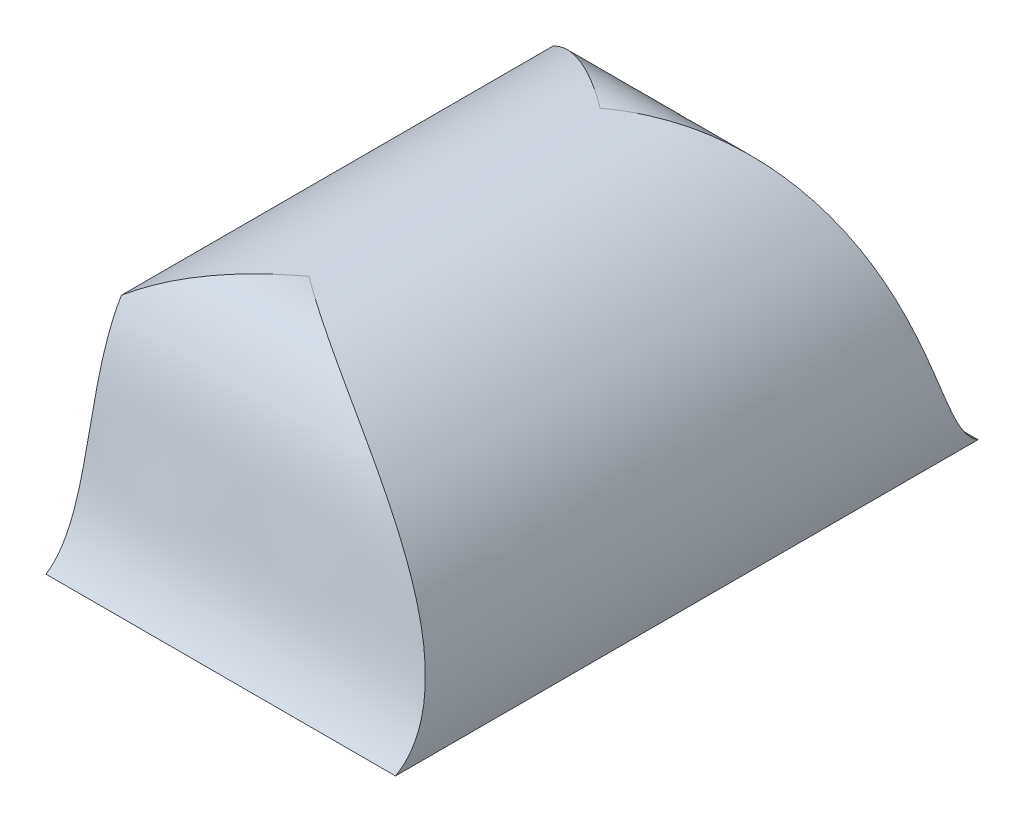
ISO-10303-21;
HEADER;
FILE_DESCRIPTION(('STEP AP214'),'2;1');
FILE_NAME('part.step','',(''),(''),'','','');
FILE_SCHEMA(('AUTOMOTIVE_DESIGN { 1 0 10303 214 1 1 1 1 }'));
ENDSEC;
DATA;
#1=APPLICATION_CONTEXT('core data for automotive mechanical design processes');
#2=APPLICATION_PROTOCOL_DEFINITION('international standard','automotive_design',2000,#1);
#3=PRODUCT_CONTEXT('',#1,'mechanical');
#4=PRODUCT('Part','Part','',(#3));
#5=PRODUCT_RELATED_PRODUCT_CATEGORY('part','',(#4));
#6=PRODUCT_DEFINITION_FORMATION('','',#4);
#7=PRODUCT_DEFINITION_CONTEXT('part definition',#1,'design');
#8=PRODUCT_DEFINITION('design','',#6,#7);
#9=PRODUCT_DEFINITION_SHAPE('','',#8);
#10=(LENGTH_UNIT() NAMED_UNIT(*) SI_UNIT(.MILLI.,.METRE.));
#11=(NAMED_UNIT(*) PLANE_ANGLE_UNIT() SI_UNIT($,.RADIAN.));
#12=(NAMED_UNIT(*) SI_UNIT($,.STERADIAN.) SOLID_ANGLE_UNIT());
#13=UNCERTAINTY_MEASURE_WITH_UNIT(LENGTH_MEASURE(1.E-05),#10,'distance_accuracy_value','');
#14=(GEOMETRIC_REPRESENTATION_CONTEXT(3) GLOBAL_UNCERTAINTY_ASSIGNED_CONTEXT((#13)) GLOBAL_UNIT_ASSIGNED_CONTEXT((#10,
#11,#12)) REPRESENTATION_CONTEXT('',''));
#15=CARTESIAN_POINT('',(0.,0.,0.));
#16=DIRECTION('',(0.,0.,1.));
#17=DIRECTION('',(1.,0.,0.));
#18=AXIS2_PLACEMENT_3D('',#15,#16,#17);
#19=CARTESIAN_POINT('',(0.6,0.,0.25));
#20=CARTESIAN_POINT('',(0.626819788030723,0.289928397578695,0.25));
#21=CARTESIAN_POINT('',(0.257985515738042,0.545390799762338,0.25));
#22=CARTESIAN_POINT('',(0.,0.35,0.25));
#23=B_SPLINE_CURVE_WITH_KNOTS('',3,(#19,#20,#21,#22),.UNSPECIFIED.,.F.,.F.,(4,4),(0.,1.),.UNSPECIFIED.);
#24=DIRECTION('',(0.,0.,-1.));
#25=VECTOR('',#24,1.);
#26=SURFACE_OF_LINEAR_EXTRUSION('',#23,#25);
#27=DIRECTION('',(0.,0.,-1.));
#28=VECTOR('',#27,1.);
#29=CARTESIAN_POINT('',(0.,0.35,0.25));
#30=LINE('',#29,#28);
#31=CARTESIAN_POINT('',(0.,0.349999999403882,0.370521911412625));
#32=VERTEX_POINT('',#31);
#33=CARTESIAN_POINT('',(0.,0.35,-0.370521911412625));
#34=VERTEX_POINT('',#33);
#35=EDGE_CURVE('E53',#32,#34,#30,.T.);
#36=ORIENTED_EDGE('',*,*,#35,.F.);
#37=CARTESIAN_POINT('',(0.,0.349999999999997,0.370521911049339));
#38=CARTESIAN_POINT('',(0.00825527885618861,0.356255849450693,0.366712872777325));
#39=CARTESIAN_POINT('',(0.01670774569311,0.362105432406488,0.362678678142125));
#40=CARTESIAN_POINT('',(0.0339234244274184,0.372950656876308,0.354163679151032));
#41=CARTESIAN_POINT('',(0.0426864991470208,0.377946669826716,0.349683070405773));
#42=CARTESIAN_POINT('',(0.0692006872566339,0.391535029749839,0.335639015499935));
#43=CARTESIAN_POINT('',(0.0872968181289452,0.398817946316962,0.325418908973627));
#44=CARTESIAN_POINT('',(0.121098640930965,0.409136187235741,0.305036802703458));
#45=CARTESIAN_POINT('',(0.136788344406358,0.412620049119834,0.29506273608286));
#46=CARTESIAN_POINT('',(0.167911899364637,0.417252919245855,0.274235900732327));
#47=CARTESIAN_POINT('',(0.183345927724373,0.418403614738341,0.263383772890552));
#48=CARTESIAN_POINT('',(0.199505616780379,0.418544612505018,0.251466641467701));
#49=CARTESIAN_POINT('',(0.2004959868034,0.418548912358348,0.250734018721069));
#50=CARTESIAN_POINT('',(0.20148518074984,0.418548901834156,0.25));
#51=B_SPLINE_CURVE_WITH_KNOTS('',3,(#37,#38,#39,#40,#41,#42,#43,#44,#45,#46,#47,#48,#49,#50),
.UNSPECIFIED.,.F.,.F.,(4,2,2,2,2,2,4),(0.,0.0330862202839932,0.0661580060149827,
0.131829646521694,0.188407274208213,0.244943972653786,0.248639634344501),.UNSPECIFIED.);
#52=CARTESIAN_POINT('',(0.201485180749996,0.418548901834156,0.25));
#53=VERTEX_POINT('',#52);
#54=EDGE_CURVE('E88',#32,#53,#51,.T.);
#55=ORIENTED_EDGE('',*,*,#54,.T.);
#56=CARTESIAN_POINT('',(0.6,0.,0.5));
#57=CARTESIAN_POINT('',(0.600309456843271,0.00328595093172608,0.494965112052997));
#58=CARTESIAN_POINT('',(0.600610500159222,0.00713623887497123,0.490374210968532));
#59=CARTESIAN_POINT('',(0.601089507162062,0.0155632954519763,0.482064447642185));
#60=CARTESIAN_POINT('',(0.601269609789353,0.0201255775204056,0.47833124373096));
#61=CARTESIAN_POINT('',(0.601454954538251,0.0320253042292035,0.469911865294647));
#62=CARTESIAN_POINT('',(0.601334354444628,0.0396417637507074,0.465631526865669));
#63=CARTESIAN_POINT('',(0.600497506607325,0.0553849172072791,0.458063979399536));
#64=CARTESIAN_POINT('',(0.599775335927399,0.0635159388713859,0.454787090636494));
#65=CARTESIAN_POINT('',(0.596748385181316,0.0872787410461483,0.446276502410716));
#66=CARTESIAN_POINT('',(0.593605748882381,0.103113037235993,0.441914948246667));
#67=CARTESIAN_POINT('',(0.5850967919933,0.134370708740922,0.43422445179017));
#68=CARTESIAN_POINT('',(0.579731364935154,0.149794246526878,0.430895095507223));
#69=CARTESIAN_POINT('',(0.564450389619757,0.185923664821895,0.423273653674747));
#70=CARTESIAN_POINT('',(0.553572727417092,0.206259340928663,0.419132877391412));
#71=CARTESIAN_POINT('',(0.528627154892707,0.244755632950418,0.410362891631758));
#72=CARTESIAN_POINT('',(0.514555513806971,0.262913667032004,0.405733114380721));
#73=CARTESIAN_POINT('',(0.483760308356701,0.296816735105153,0.395298023187908));
#74=CARTESIAN_POINT('',(0.467009350638104,0.312533119150924,0.389480372983261));
#75=CARTESIAN_POINT('',(0.431674713054268,0.34095582958504,0.376272103483193));
#76=CARTESIAN_POINT('',(0.413091112238233,0.353662285723215,0.368881552017362));
#77=CARTESIAN_POINT('',(0.37410456686757,0.37618621593128,0.351965538274795));
#78=CARTESIAN_POINT('',(0.353659961186571,0.385881205949137,0.342371952666841));
#79=CARTESIAN_POINT('',(0.312432573313025,0.401528263512743,0.321154569651431));
#80=CARTESIAN_POINT('',(0.291650113315865,0.407483704514568,0.309532614173704));
#81=CARTESIAN_POINT('',(0.248455423708947,0.416086356109303,0.283111456839611));
#82=CARTESIAN_POINT('',(0.226085830064731,0.418347151703636,0.268111510903899));
#83=CARTESIAN_POINT('',(0.203465071608549,0.418544642715857,0.251466128242887));
#84=CARTESIAN_POINT('',(0.202474322305935,0.418548944688426,0.250734015315585));
#85=CARTESIAN_POINT('',(0.20148518074984,0.418548901834156,0.25));
#86=B_SPLINE_CURVE_WITH_KNOTS('',3,(#56,#57,#58,#59,#60,#61,#62,#63,#64,#65,#66,#67,#68,#69,#70,
#71,#72,#73,#74,#75,#76,#77,#78,#79,#80,#81,#82,#83,#84,#85),.UNSPECIFIED.,.F.,.F.,(4,2,2,2,2,2,
2,2,2,2,2,2,2,2,4),(0.,0.0179271297373814,0.0355282081543646,0.0615987211301575,
0.0879289952653558,0.137815573256445,0.187682116942603,0.257603420179295,0.327606819977274,
0.398378012167399,0.469146153047947,0.542499334026183,0.615786247498508,0.696337234710239,
0.700032899617386),.UNSPECIFIED.);
#87=CARTESIAN_POINT('',(0.6,0.,0.5));
#88=VERTEX_POINT('',#87);
#89=EDGE_CURVE('E90',#53,#88,#86,.F.);
#90=ORIENTED_EDGE('',*,*,#89,.T.);
#91=DIRECTION('',(0.,0.,-1.));
#92=VECTOR('',#91,1.);
#93=CARTESIAN_POINT('',(0.6,0.,0.25));
#94=LINE('',#93,#92);
#95=CARTESIAN_POINT('',(0.6,0.,-0.5));
#96=VERTEX_POINT('',#95);
#97=EDGE_CURVE('E102',#88,#96,#94,.T.);
#98=ORIENTED_EDGE('',*,*,#97,.T.);
#99=CARTESIAN_POINT('',(0.6,0.,-0.5));
#100=CARTESIAN_POINT('',(0.600309456843271,0.00328595093172607,-0.494965112052997));
#101=CARTESIAN_POINT('',(0.600610500159222,0.00713623887497124,-0.490374210968532));
#102=CARTESIAN_POINT('',(0.601089507162062,0.0155632954519763,-0.482064447642185));
#103=CARTESIAN_POINT('',(0.601269609789353,0.0201255775204056,-0.47833124373096));
#104=CARTESIAN_POINT('',(0.601454954538251,0.0320253042292035,-0.469911865294647));
#105=CARTESIAN_POINT('',(0.601334354444628,0.0396417637507074,-0.465631526865669));
#106=CARTESIAN_POINT('',(0.600497506607325,0.0553849172072791,-0.458063979399536));
#107=CARTESIAN_POINT('',(0.5997753359274,0.0635159388713859,-0.454787090636494));
#108=CARTESIAN_POINT('',(0.596748385181316,0.0872787410461483,-0.446276502410716));
#109=CARTESIAN_POINT('',(0.593605748882381,0.103113037235993,-0.441914948246667));
#110=CARTESIAN_POINT('',(0.585096791993299,0.134370708740922,-0.43422445179017));
#111=CARTESIAN_POINT('',(0.579731364935154,0.149794246526878,-0.430895095507223));
#112=CARTESIAN_POINT('',(0.564450389619757,0.185923664821896,-0.423273653674747));
#113=CARTESIAN_POINT('',(0.553572727417092,0.206259340928664,-0.419132877391411));
#114=CARTESIAN_POINT('',(0.528627154892706,0.244755632950419,-0.410362891631758));
#115=CARTESIAN_POINT('',(0.51455551380697,0.262913667032004,-0.40573311438072));
#116=CARTESIAN_POINT('',(0.4837603083567,0.296816735105154,-0.395298023187908));
#117=CARTESIAN_POINT('',(0.467009350638103,0.312533119150925,-0.389480372983261));
#118=CARTESIAN_POINT('',(0.431674713054267,0.340955829585041,-0.376272103483192));
#119=CARTESIAN_POINT('',(0.413091112238231,0.353662285723216,-0.368881552017362));
#120=CARTESIAN_POINT('',(0.374104566867568,0.376186215931281,-0.351965538274795));
#121=CARTESIAN_POINT('',(0.353659961186569,0.385881205949137,-0.342371952666839));
#122=CARTESIAN_POINT('',(0.312432573313022,0.401528263512743,-0.321154569651431));
#123=CARTESIAN_POINT('',(0.291650113315862,0.407483704514568,-0.309532614173706));
#124=CARTESIAN_POINT('',(0.248455423708948,0.416086356109303,-0.283111456839608));
#125=CARTESIAN_POINT('',(0.226085830064738,0.418347151703636,-0.268111510903888));
#126=CARTESIAN_POINT('',(0.203465071608549,0.418544642715857,-0.251466128242886));
#127=CARTESIAN_POINT('',(0.202474322305935,0.418548944688426,-0.250734015315584));
#128=CARTESIAN_POINT('',(0.20148518074984,0.418548901834156,-0.25));
#129=B_SPLINE_CURVE_WITH_KNOTS('',3,(#99,#100,#101,#102,#103,#104,#105,#106,#107,#108,#109,#110,
#111,#112,#113,#114,#115,#116,#117,#118,#119,#120,#121,#122,#123,#124,#125,#126,#127,#128),
.UNSPECIFIED.,.F.,.F.,(4,2,2,2,2,2,2,2,2,2,2,2,2,2,4),(0.,0.0179271297373815,0.0355282081543646,
0.0615987211301575,0.0879289952653557,0.137815573256446,0.187682116942604,0.257603420179296,
0.327606819977276,0.3983780121674,0.469146153047948,0.542499334026186,0.615786247498509,
0.696337234710239,0.700032899617385),.UNSPECIFIED.);
#130=CARTESIAN_POINT('',(0.201486085555685,0.418548901832957,-0.25));
#131=VERTEX_POINT('',#130);
#132=EDGE_CURVE('E133',#131,#96,#129,.F.);
#133=ORIENTED_EDGE('',*,*,#132,.F.);
#134=CARTESIAN_POINT('',(0.,0.349999999999997,-0.370521911049339));
#135=CARTESIAN_POINT('',(0.00825527885619393,0.356255849450697,-0.366712872777322));
#136=CARTESIAN_POINT('',(0.0167077456931216,0.362105432406496,-0.362678678142119));
#137=CARTESIAN_POINT('',(0.0339234244274423,0.372950656876322,-0.354163679151021));
#138=CARTESIAN_POINT('',(0.0426864991470509,0.377946669826733,-0.349683070405758));
#139=CARTESIAN_POINT('',(0.0692006872566738,0.391535029749857,-0.335639015499912));
#140=CARTESIAN_POINT('',(0.087296818128987,0.398817946316979,-0.325418908973595));
#141=CARTESIAN_POINT('',(0.121098640931009,0.409136187235751,-0.305036802703437));
#142=CARTESIAN_POINT('',(0.136788344406402,0.412620049119839,-0.295062736082856));
#143=CARTESIAN_POINT('',(0.16791189936464,0.417252919245856,-0.2742359007323));
#144=CARTESIAN_POINT('',(0.183345927724335,0.418403614738342,-0.263383772890485));
#145=CARTESIAN_POINT('',(0.199505616780374,0.418544612505018,-0.251466641467692));
#146=CARTESIAN_POINT('',(0.200495986803397,0.418548912358348,-0.250734018721065));
#147=CARTESIAN_POINT('',(0.20148518074984,0.418548901834156,-0.25));
#148=B_SPLINE_CURVE_WITH_KNOTS('',3,(#134,#135,#136,#137,#138,#139,#140,#141,#142,#143,#144,
#145,#146,#147),.UNSPECIFIED.,.F.,.F.,(4,2,2,2,2,2,4),(0.,0.0330862202840161,0.0661580060150272,
0.131829646521755,0.18840727420824,0.244943972653787,0.2486396343445),.UNSPECIFIED.);
#149=EDGE_CURVE('E11',#34,#131,#148,.T.);
#150=ORIENTED_EDGE('',*,*,#149,.F.);
#151=EDGE_LOOP('',(#36,#55,#90,#98,#133,#150));
#152=FACE_BOUND('',#151,.T.);
#153=ADVANCED_FACE('F39',(#152),#26,.F.);
#154=CARTESIAN_POINT('',(0.,0.35,0.25));
#155=DIRECTION('',(1.,0.,0.));
#156=DIRECTION('',(0.,1.,0.));
#157=AXIS2_PLACEMENT_3D('',#154,#155,#156);
#158=PLANE('',#157);
#159=CARTESIAN_POINT('',(0.,0.,0.5));
#160=CARTESIAN_POINT('',(0.,0.0714905444473845,0.390864989579389));
#161=CARTESIAN_POINT('',(0.,0.418548901834156,0.458561006871926));
#162=CARTESIAN_POINT('',(0.,0.418548901834156,0.25));
#163=B_SPLINE_CURVE_WITH_KNOTS('',3,(#159,#160,#161,#162),.UNSPECIFIED.,.F.,.F.,(4,4),(0.,1.),.UNSPECIFIED.);
#164=CARTESIAN_POINT('',(0.,0.,0.5));
#165=VERTEX_POINT('',#164);
#166=EDGE_CURVE('E107',#165,#32,#163,.T.);
#167=ORIENTED_EDGE('',*,*,#166,.T.);
#168=ORIENTED_EDGE('',*,*,#35,.T.);
#169=CARTESIAN_POINT('',(0.,0.,-0.5));
#170=CARTESIAN_POINT('',(0.,0.0714905444473845,-0.390864989579389));
#171=CARTESIAN_POINT('',(0.,0.418548901834156,-0.458561006871926));
#172=CARTESIAN_POINT('',(0.,0.418548901834156,-0.25));
#173=B_SPLINE_CURVE_WITH_KNOTS('',3,(#169,#170,#171,#172),.UNSPECIFIED.,.F.,.F.,(4,4),(0.,1.),.UNSPECIFIED.);
#174=CARTESIAN_POINT('',(0.,0.,-0.5));
#175=VERTEX_POINT('',#174);
#176=EDGE_CURVE('E96',#175,#34,#173,.T.);
#177=ORIENTED_EDGE('',*,*,#176,.F.);
#178=DIRECTION('',(0.,0.,-1.));
#179=VECTOR('',#178,1.);
#180=CARTESIAN_POINT('',(0.,0.,0.25));
#181=LINE('',#180,#179);
#182=EDGE_CURVE('E105',#165,#175,#181,.T.);
#183=ORIENTED_EDGE('',*,*,#182,.F.);
#184=EDGE_LOOP('',(#167,#168,#177,#183));
#185=FACE_BOUND('',#184,.T.);
#186=ADVANCED_FACE('F158',(#185),#158,.F.);
#187=CARTESIAN_POINT('',(0.,0.,0.25));
#188=DIRECTION('',(0.,1.,0.));
#189=DIRECTION('',(0.,0.,1.));
#190=AXIS2_PLACEMENT_3D('',#187,#188,#189);
#191=PLANE('',#190);
#192=ORIENTED_EDGE('',*,*,#182,.T.);
#193=DIRECTION('',(-1.,0.,0.));
#194=VECTOR('',#193,1.);
#195=CARTESIAN_POINT('',(0.627446635869675,0.,-0.5));
#196=LINE('',#195,#194);
#197=EDGE_CURVE('E115',#96,#175,#196,.T.);
#198=ORIENTED_EDGE('',*,*,#197,.F.);
#199=ORIENTED_EDGE('',*,*,#97,.F.);
#200=DIRECTION('',(-1.,0.,0.));
#201=VECTOR('',#200,1.);
#202=CARTESIAN_POINT('',(0.614409894015362,0.,0.5));
#203=LINE('',#202,#201);
#204=EDGE_CURVE('E100',#88,#165,#203,.T.);
#205=ORIENTED_EDGE('',*,*,#204,.T.);
#206=EDGE_LOOP('',(#192,#198,#199,#205));
#207=FACE_BOUND('',#206,.T.);
#208=ADVANCED_FACE('F125',(#207),#191,.F.);
#209=CARTESIAN_POINT('',(0.614409894015362,0.,0.5));
#210=CARTESIAN_POINT('',(0.614409894015362,0.0714905444473845,0.390864989579389));
#211=CARTESIAN_POINT('',(0.614409894015362,0.418548901834156,0.458561006871926));
#212=CARTESIAN_POINT('',(0.614409894015362,0.418548901834156,0.25));
#213=B_SPLINE_CURVE_WITH_KNOTS('',3,(#209,#210,#211,#212),.UNSPECIFIED.,.F.,.F.,(4,4),(0.,1.),.UNSPECIFIED.);
#214=DIRECTION('',(-1.,0.,0.));
#215=VECTOR('',#214,1.);
#216=SURFACE_OF_LINEAR_EXTRUSION('',#213,#215);
#217=ORIENTED_EDGE('',*,*,#54,.F.);
#218=ORIENTED_EDGE('',*,*,#166,.F.);
#219=ORIENTED_EDGE('',*,*,#204,.F.);
#220=ORIENTED_EDGE('',*,*,#89,.F.);
#221=EDGE_LOOP('',(#217,#218,#219,#220));
#222=FACE_BOUND('',#221,.T.);
#223=ADVANCED_FACE('F98',(#222),#216,.T.);
#224=CARTESIAN_POINT('',(0.627446635869675,0.,-0.5));
#225=CARTESIAN_POINT('',(0.627446635869675,0.0714905444473845,-0.390864989579389));
#226=CARTESIAN_POINT('',(0.627446635869675,0.418548901834156,-0.458561006871926));
#227=CARTESIAN_POINT('',(0.627446635869675,0.418548901834156,-0.25));
#228=B_SPLINE_CURVE_WITH_KNOTS('',3,(#224,#225,#226,#227),.UNSPECIFIED.,.F.,.F.,(4,4),(0.,1.),.UNSPECIFIED.);
#229=DIRECTION('',(-1.,0.,0.));
#230=VECTOR('',#229,1.);
#231=SURFACE_OF_LINEAR_EXTRUSION('',#228,#230);
#232=ORIENTED_EDGE('',*,*,#176,.T.);
#233=ORIENTED_EDGE('',*,*,#149,.T.);
#234=ORIENTED_EDGE('',*,*,#132,.T.);
#235=ORIENTED_EDGE('',*,*,#197,.T.);
#236=EDGE_LOOP('',(#232,#233,#234,#235));
#237=FACE_BOUND('',#236,.T.);
#238=ADVANCED_FACE('F124',(#237),#231,.F.);
#239=CLOSED_SHELL('',(#153,#186,#208,#223,#238));
#240=MANIFOLD_SOLID_BREP('B2',#239);
#241=ADVANCED_BREP_SHAPE_REPRESENTATION('',(#18,#240),#14);
#242=SHAPE_DEFINITION_REPRESENTATION(#9,#241);
ENDSEC;
END-ISO-10303-21;
